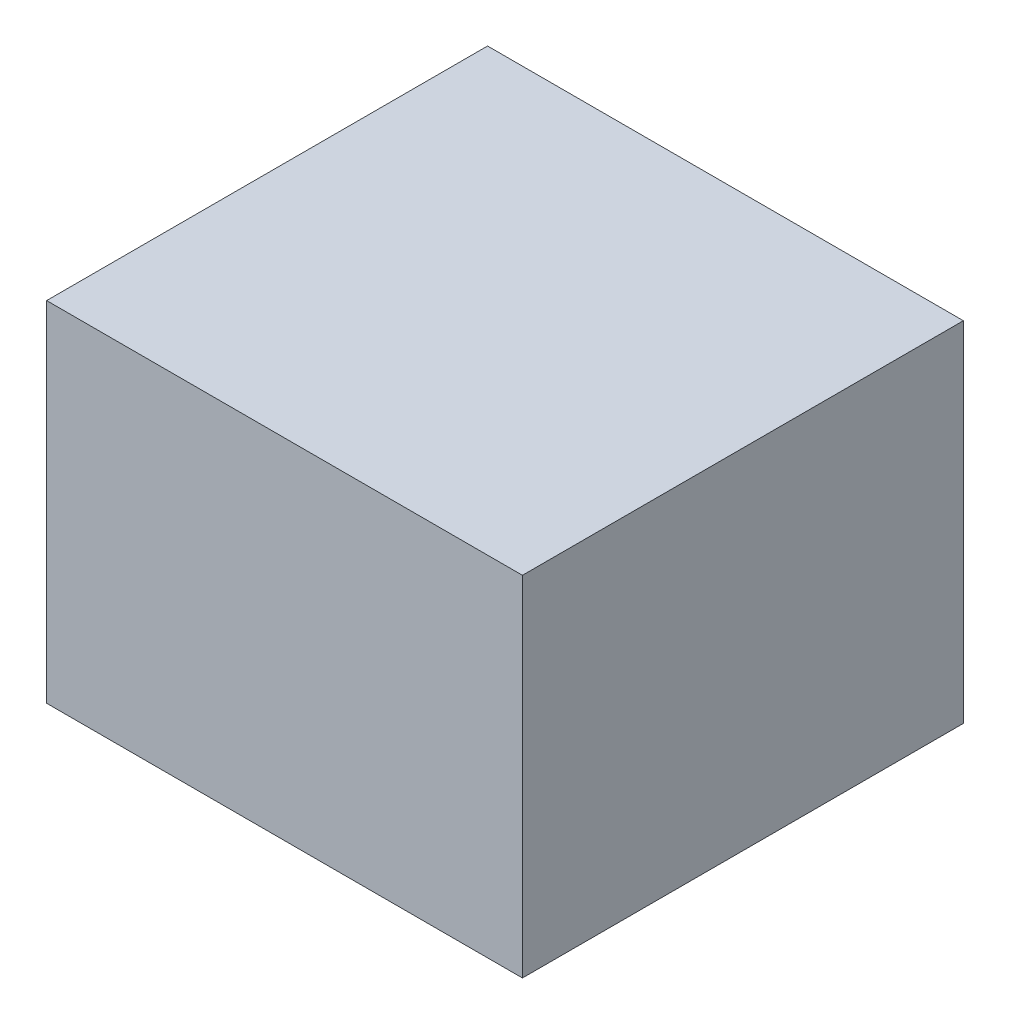
ISO-10303-21;
HEADER;
FILE_DESCRIPTION(('STEP AP214'),'2;1');
FILE_NAME('part.step','',(''),(''),'','','');
FILE_SCHEMA(('AUTOMOTIVE_DESIGN { 1 0 10303 214 1 1 1 1 }'));
ENDSEC;
DATA;
#1=APPLICATION_CONTEXT('core data for automotive mechanical design processes');
#2=APPLICATION_PROTOCOL_DEFINITION('international standard','automotive_design',2000,#1);
#3=PRODUCT_CONTEXT('',#1,'mechanical');
#4=PRODUCT('Part','Part','',(#3));
#5=PRODUCT_RELATED_PRODUCT_CATEGORY('part','',(#4));
#6=PRODUCT_DEFINITION_FORMATION('','',#4);
#7=PRODUCT_DEFINITION_CONTEXT('part definition',#1,'design');
#8=PRODUCT_DEFINITION('design','',#6,#7);
#9=PRODUCT_DEFINITION_SHAPE('','',#8);
#10=(LENGTH_UNIT() NAMED_UNIT(*) SI_UNIT(.MILLI.,.METRE.));
#11=(NAMED_UNIT(*) PLANE_ANGLE_UNIT() SI_UNIT($,.RADIAN.));
#12=(NAMED_UNIT(*) SI_UNIT($,.STERADIAN.) SOLID_ANGLE_UNIT());
#13=UNCERTAINTY_MEASURE_WITH_UNIT(LENGTH_MEASURE(1.E-05),#10,'distance_accuracy_value','');
#14=(GEOMETRIC_REPRESENTATION_CONTEXT(3) GLOBAL_UNCERTAINTY_ASSIGNED_CONTEXT((#13)) GLOBAL_UNIT_ASSIGNED_CONTEXT((#10,
#11,#12)) REPRESENTATION_CONTEXT('',''));
#15=CARTESIAN_POINT('',(0.,0.,0.));
#16=DIRECTION('',(0.,0.,1.));
#17=DIRECTION('',(1.,0.,0.));
#18=AXIS2_PLACEMENT_3D('',#15,#16,#17);
#19=CARTESIAN_POINT('',(-2.4257,1.778,0.));
#20=DIRECTION('',(0.,1.,0.));
#21=DIRECTION('',(0.,0.,1.));
#22=AXIS2_PLACEMENT_3D('',#19,#20,#21);
#23=PLANE('',#22);
#24=DIRECTION('',(0.,0.,-1.));
#25=VECTOR('',#24,1.);
#26=CARTESIAN_POINT('',(2.4257,1.778,0.));
#27=LINE('',#26,#25);
#28=CARTESIAN_POINT('',(2.4257,1.778,0.));
#29=VERTEX_POINT('',#28);
#30=CARTESIAN_POINT('',(2.4257,1.778,4.4958));
#31=VERTEX_POINT('',#30);
#32=EDGE_CURVE('E20',#29,#31,#27,.F.);
#33=ORIENTED_EDGE('',*,*,#32,.F.);
#34=DIRECTION('',(1.,0.,0.));
#35=VECTOR('',#34,1.);
#36=CARTESIAN_POINT('',(2.4257,1.778,0.));
#37=LINE('',#36,#35);
#38=CARTESIAN_POINT('',(-2.4257,1.778,0.));
#39=VERTEX_POINT('',#38);
#40=EDGE_CURVE('E79',#29,#39,#37,.F.);
#41=ORIENTED_EDGE('',*,*,#40,.T.);
#42=DIRECTION('',(0.,0.,1.));
#43=VECTOR('',#42,1.);
#44=CARTESIAN_POINT('',(-2.4257,1.778,0.));
#45=LINE('',#44,#43);
#46=CARTESIAN_POINT('',(-2.4257,1.778,4.4958));
#47=VERTEX_POINT('',#46);
#48=EDGE_CURVE('E61',#47,#39,#45,.F.);
#49=ORIENTED_EDGE('',*,*,#48,.F.);
#50=DIRECTION('',(1.,0.,0.));
#51=VECTOR('',#50,1.);
#52=CARTESIAN_POINT('',(2.4257,1.778,4.4958));
#53=LINE('',#52,#51);
#54=EDGE_CURVE('E56',#31,#47,#53,.F.);
#55=ORIENTED_EDGE('',*,*,#54,.F.);
#56=EDGE_LOOP('',(#33,#41,#49,#55));
#57=FACE_BOUND('',#56,.T.);
#58=ADVANCED_FACE('F17',(#57),#23,.T.);
#59=CARTESIAN_POINT('',(2.4257,1.778,0.));
#60=DIRECTION('',(1.,0.,0.));
#61=DIRECTION('',(0.,0.,-1.));
#62=AXIS2_PLACEMENT_3D('',#59,#60,#61);
#63=PLANE('',#62);
#64=DIRECTION('',(0.,0.,-1.));
#65=VECTOR('',#64,1.);
#66=CARTESIAN_POINT('',(2.4257,-1.778,0.));
#67=LINE('',#66,#65);
#68=CARTESIAN_POINT('',(2.4257,-1.778,0.));
#69=VERTEX_POINT('',#68);
#70=CARTESIAN_POINT('',(2.4257,-1.778,4.4958));
#71=VERTEX_POINT('',#70);
#72=EDGE_CURVE('E83',#69,#71,#67,.F.);
#73=ORIENTED_EDGE('',*,*,#72,.F.);
#74=DIRECTION('',(0.,1.,0.));
#75=VECTOR('',#74,1.);
#76=CARTESIAN_POINT('',(2.4257,1.778,0.));
#77=LINE('',#76,#75);
#78=EDGE_CURVE('E68',#69,#29,#77,.T.);
#79=ORIENTED_EDGE('',*,*,#78,.T.);
#80=ORIENTED_EDGE('',*,*,#32,.T.);
#81=DIRECTION('',(0.,1.,0.));
#82=VECTOR('',#81,1.);
#83=CARTESIAN_POINT('',(2.4257,1.778,4.4958));
#84=LINE('',#83,#82);
#85=EDGE_CURVE('E63',#71,#31,#84,.T.);
#86=ORIENTED_EDGE('',*,*,#85,.F.);
#87=EDGE_LOOP('',(#73,#79,#80,#86));
#88=FACE_BOUND('',#87,.T.);
#89=ADVANCED_FACE('F65',(#88),#63,.T.);
#90=CARTESIAN_POINT('',(2.4257,1.778,4.4958));
#91=DIRECTION('',(0.,0.,1.));
#92=DIRECTION('',(1.,0.,0.));
#93=AXIS2_PLACEMENT_3D('',#90,#91,#92);
#94=PLANE('',#93);
#95=DIRECTION('',(1.,0.,0.));
#96=VECTOR('',#95,1.);
#97=CARTESIAN_POINT('',(2.4257,-1.778,4.4958));
#98=LINE('',#97,#96);
#99=CARTESIAN_POINT('',(-2.4257,-1.778,4.4958));
#100=VERTEX_POINT('',#99);
#101=EDGE_CURVE('E72',#71,#100,#98,.F.);
#102=ORIENTED_EDGE('',*,*,#101,.F.);
#103=ORIENTED_EDGE('',*,*,#85,.T.);
#104=ORIENTED_EDGE('',*,*,#54,.T.);
#105=DIRECTION('',(0.,1.,0.));
#106=VECTOR('',#105,1.);
#107=CARTESIAN_POINT('',(-2.4257,-1.778,4.4958));
#108=LINE('',#107,#106);
#109=EDGE_CURVE('E74',#100,#47,#108,.T.);
#110=ORIENTED_EDGE('',*,*,#109,.F.);
#111=EDGE_LOOP('',(#102,#103,#104,#110));
#112=FACE_BOUND('',#111,.T.);
#113=ADVANCED_FACE('F70',(#112),#94,.T.);
#114=CARTESIAN_POINT('',(-2.4257,-1.778,0.));
#115=DIRECTION('',(-1.,0.,0.));
#116=DIRECTION('',(0.,0.,1.));
#117=AXIS2_PLACEMENT_3D('',#114,#115,#116);
#118=PLANE('',#117);
#119=ORIENTED_EDGE('',*,*,#48,.T.);
#120=DIRECTION('',(0.,1.,0.));
#121=VECTOR('',#120,1.);
#122=CARTESIAN_POINT('',(-2.4257,1.778,0.));
#123=LINE('',#122,#121);
#124=CARTESIAN_POINT('',(-2.4257,-1.778,0.));
#125=VERTEX_POINT('',#124);
#126=EDGE_CURVE('E35',#39,#125,#123,.F.);
#127=ORIENTED_EDGE('',*,*,#126,.T.);
#128=DIRECTION('',(0.,0.,-1.));
#129=VECTOR('',#128,1.);
#130=CARTESIAN_POINT('',(-2.4257,-1.778,0.));
#131=LINE('',#130,#129);
#132=EDGE_CURVE('E26',#100,#125,#131,.T.);
#133=ORIENTED_EDGE('',*,*,#132,.F.);
#134=ORIENTED_EDGE('',*,*,#109,.T.);
#135=EDGE_LOOP('',(#119,#127,#133,#134));
#136=FACE_BOUND('',#135,.T.);
#137=ADVANCED_FACE('F89',(#136),#118,.T.);
#138=CARTESIAN_POINT('',(2.4257,1.778,0.));
#139=DIRECTION('',(0.,0.,1.));
#140=DIRECTION('',(1.,0.,0.));
#141=AXIS2_PLACEMENT_3D('',#138,#139,#140);
#142=PLANE('',#141);
#143=DIRECTION('',(1.,0.,0.));
#144=VECTOR('',#143,1.);
#145=CARTESIAN_POINT('',(2.4257,-1.778,0.));
#146=LINE('',#145,#144);
#147=EDGE_CURVE('E11',#125,#69,#146,.T.);
#148=ORIENTED_EDGE('',*,*,#147,.F.);
#149=ORIENTED_EDGE('',*,*,#126,.F.);
#150=ORIENTED_EDGE('',*,*,#40,.F.);
#151=ORIENTED_EDGE('',*,*,#78,.F.);
#152=EDGE_LOOP('',(#148,#149,#150,#151));
#153=FACE_BOUND('',#152,.T.);
#154=ADVANCED_FACE('F91',(#153),#142,.F.);
#155=CARTESIAN_POINT('',(2.4257,-1.778,0.));
#156=DIRECTION('',(0.,-1.,0.));
#157=DIRECTION('',(0.,0.,-1.));
#158=AXIS2_PLACEMENT_3D('',#155,#156,#157);
#159=PLANE('',#158);
#160=ORIENTED_EDGE('',*,*,#132,.T.);
#161=ORIENTED_EDGE('',*,*,#147,.T.);
#162=ORIENTED_EDGE('',*,*,#72,.T.);
#163=ORIENTED_EDGE('',*,*,#101,.T.);
#164=EDGE_LOOP('',(#160,#161,#162,#163));
#165=FACE_BOUND('',#164,.T.);
#166=ADVANCED_FACE('F88',(#165),#159,.T.);
#167=CLOSED_SHELL('',(#58,#89,#113,#137,#154,#166));
#168=MANIFOLD_SOLID_BREP('B1',#167);
#169=ADVANCED_BREP_SHAPE_REPRESENTATION('',(#18,#168),#14);
#170=SHAPE_DEFINITION_REPRESENTATION(#9,#169);
ENDSEC;
END-ISO-10303-21;
